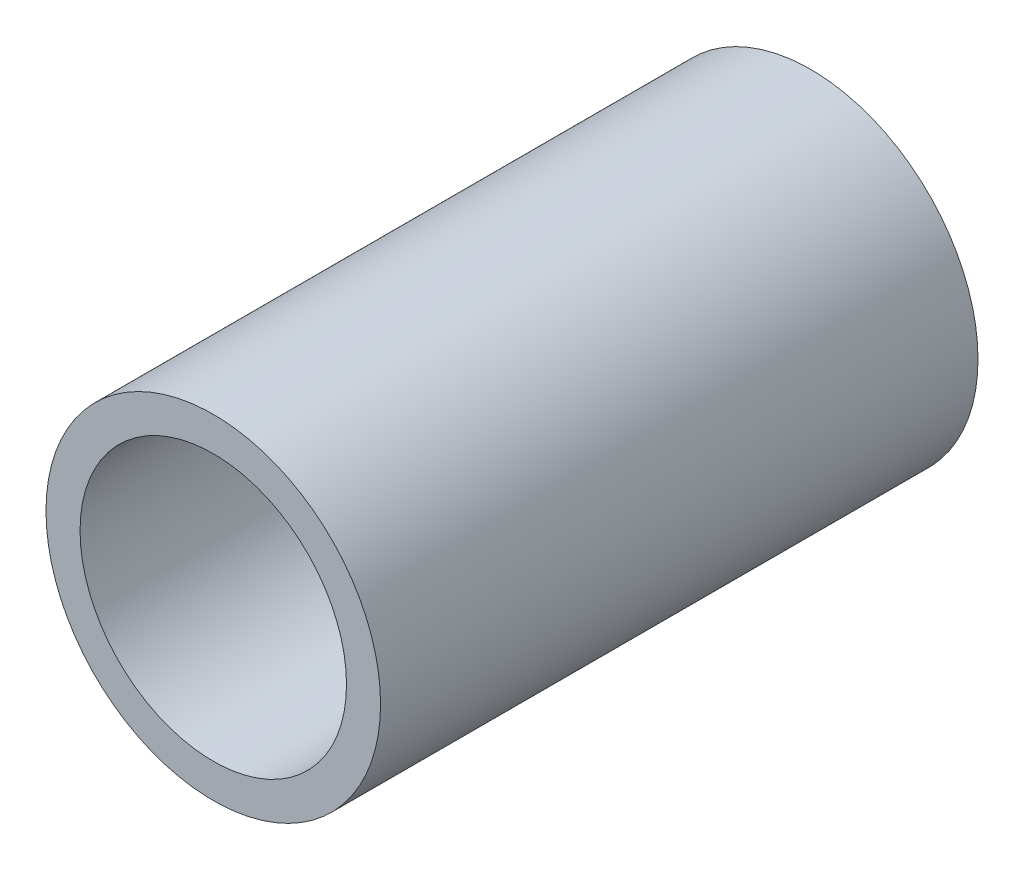
ISO-10303-21;
HEADER;
FILE_DESCRIPTION(('STEP AP214'),'2;1');
FILE_NAME('part.step','',(''),(''),'','','');
FILE_SCHEMA(('AUTOMOTIVE_DESIGN { 1 0 10303 214 1 1 1 1 }'));
ENDSEC;
DATA;
#1=APPLICATION_CONTEXT('core data for automotive mechanical design processes');
#2=APPLICATION_PROTOCOL_DEFINITION('international standard','automotive_design',2000,#1);
#3=PRODUCT_CONTEXT('',#1,'mechanical');
#4=PRODUCT('Part','Part','',(#3));
#5=PRODUCT_RELATED_PRODUCT_CATEGORY('part','',(#4));
#6=PRODUCT_DEFINITION_FORMATION('','',#4);
#7=PRODUCT_DEFINITION_CONTEXT('part definition',#1,'design');
#8=PRODUCT_DEFINITION('design','',#6,#7);
#9=PRODUCT_DEFINITION_SHAPE('','',#8);
#10=(LENGTH_UNIT() NAMED_UNIT(*) SI_UNIT(.MILLI.,.METRE.));
#11=(NAMED_UNIT(*) PLANE_ANGLE_UNIT() SI_UNIT($,.RADIAN.));
#12=(NAMED_UNIT(*) SI_UNIT($,.STERADIAN.) SOLID_ANGLE_UNIT());
#13=UNCERTAINTY_MEASURE_WITH_UNIT(LENGTH_MEASURE(1.E-05),#10,'distance_accuracy_value','');
#14=(GEOMETRIC_REPRESENTATION_CONTEXT(3) GLOBAL_UNCERTAINTY_ASSIGNED_CONTEXT((#13)) GLOBAL_UNIT_ASSIGNED_CONTEXT((#10,
#11,#12)) REPRESENTATION_CONTEXT('',''));
#15=CARTESIAN_POINT('',(0.,0.,0.));
#16=DIRECTION('',(0.,0.,1.));
#17=DIRECTION('',(1.,0.,0.));
#18=AXIS2_PLACEMENT_3D('',#15,#16,#17);
#19=CARTESIAN_POINT('',(2.25364909633613,0.,50.));
#20=DIRECTION('',(0.,0.,1.));
#21=DIRECTION('',(1.,0.,0.));
#22=AXIS2_PLACEMENT_3D('',#19,#20,#21);
#23=PLANE('',#22);
#24=CARTESIAN_POINT('',(2.25364909633613,0.,50.));
#25=DIRECTION('',(0.,0.,1.));
#26=DIRECTION('',(1.,0.,0.));
#27=AXIS2_PLACEMENT_3D('',#24,#25,#26);
#28=CIRCLE('',#27,14.);
#29=CARTESIAN_POINT('',(16.2536490963361,0.,50.));
#30=VERTEX_POINT('',#29);
#31=EDGE_CURVE('E10',#30,#30,#28,.T.);
#32=ORIENTED_EDGE('',*,*,#31,.T.);
#33=EDGE_LOOP('',(#32));
#34=FACE_BOUND('',#33,.T.);
#35=CARTESIAN_POINT('',(2.25364909633613,0.,50.));
#36=DIRECTION('',(0.,0.,1.));
#37=DIRECTION('',(1.,0.,0.));
#38=AXIS2_PLACEMENT_3D('',#35,#36,#37);
#39=CIRCLE('',#38,11.15);
#40=CARTESIAN_POINT('',(13.4036490963361,0.,50.));
#41=VERTEX_POINT('',#40);
#42=EDGE_CURVE('E50',#41,#41,#39,.T.);
#43=ORIENTED_EDGE('',*,*,#42,.F.);
#44=EDGE_LOOP('',(#43));
#45=FACE_BOUND('',#44,.T.);
#46=ADVANCED_FACE('F37',(#34,#45),#23,.T.);
#47=CARTESIAN_POINT('',(2.25364909633613,0.,0.));
#48=DIRECTION('',(0.,0.,1.));
#49=DIRECTION('',(1.,0.,0.));
#50=AXIS2_PLACEMENT_3D('',#47,#48,#49);
#51=PLANE('',#50);
#52=CARTESIAN_POINT('',(2.25364909633613,0.,0.));
#53=DIRECTION('',(0.,0.,1.));
#54=DIRECTION('',(1.,0.,0.));
#55=AXIS2_PLACEMENT_3D('',#52,#53,#54);
#56=CIRCLE('',#55,14.);
#57=CARTESIAN_POINT('',(16.2536490963361,0.,0.));
#58=VERTEX_POINT('',#57);
#59=EDGE_CURVE('E41',#58,#58,#56,.T.);
#60=ORIENTED_EDGE('',*,*,#59,.F.);
#61=EDGE_LOOP('',(#60));
#62=FACE_BOUND('',#61,.T.);
#63=CARTESIAN_POINT('',(2.25364909633613,0.,0.));
#64=DIRECTION('',(0.,0.,1.));
#65=DIRECTION('',(1.,0.,0.));
#66=AXIS2_PLACEMENT_3D('',#63,#64,#65);
#67=CIRCLE('',#66,11.15);
#68=CARTESIAN_POINT('',(13.4036490963361,0.,0.));
#69=VERTEX_POINT('',#68);
#70=EDGE_CURVE('E52',#69,#69,#67,.T.);
#71=ORIENTED_EDGE('',*,*,#70,.T.);
#72=EDGE_LOOP('',(#71));
#73=FACE_BOUND('',#72,.T.);
#74=ADVANCED_FACE('F64',(#62,#73),#51,.F.);
#75=CARTESIAN_POINT('',(2.25364909633613,0.,50.));
#76=DIRECTION('',(0.,0.,-1.));
#77=DIRECTION('',(-1.,0.,0.));
#78=AXIS2_PLACEMENT_3D('',#75,#76,#77);
#79=CYLINDRICAL_SURFACE('',#78,14.);
#80=ORIENTED_EDGE('',*,*,#31,.F.);
#81=EDGE_LOOP('',(#80));
#82=FACE_BOUND('',#81,.T.);
#83=ORIENTED_EDGE('',*,*,#59,.T.);
#84=EDGE_LOOP('',(#83));
#85=FACE_BOUND('',#84,.T.);
#86=ADVANCED_FACE('F39',(#82,#85),#79,.T.);
#87=CARTESIAN_POINT('',(2.25364909633613,0.,50.));
#88=DIRECTION('',(0.,0.,-1.));
#89=DIRECTION('',(-1.,0.,0.));
#90=AXIS2_PLACEMENT_3D('',#87,#88,#89);
#91=CYLINDRICAL_SURFACE('',#90,11.15);
#92=ORIENTED_EDGE('',*,*,#42,.T.);
#93=EDGE_LOOP('',(#92));
#94=FACE_BOUND('',#93,.T.);
#95=ORIENTED_EDGE('',*,*,#70,.F.);
#96=EDGE_LOOP('',(#95));
#97=FACE_BOUND('',#96,.T.);
#98=ADVANCED_FACE('F60',(#94,#97),#91,.F.);
#99=CLOSED_SHELL('',(#46,#74,#86,#98));
#100=MANIFOLD_SOLID_BREP('B2',#99);
#101=ADVANCED_BREP_SHAPE_REPRESENTATION('',(#18,#100),#14);
#102=SHAPE_DEFINITION_REPRESENTATION(#9,#101);
ENDSEC;
END-ISO-10303-21;
